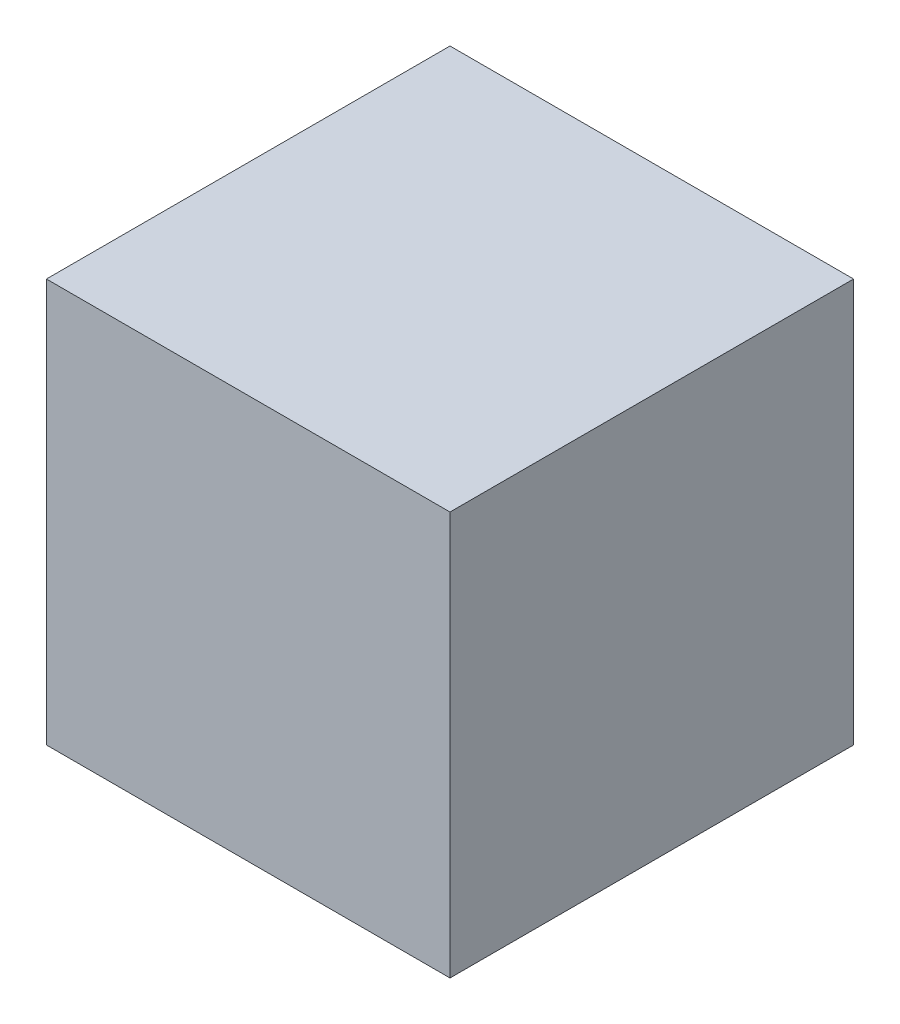
ISO-10303-21;
HEADER;
FILE_DESCRIPTION(('STEP AP214'),'2;1');
FILE_NAME('part.step','',(''),(''),'','','');
FILE_SCHEMA(('AUTOMOTIVE_DESIGN { 1 0 10303 214 1 1 1 1 }'));
ENDSEC;
DATA;
#1=APPLICATION_CONTEXT('core data for automotive mechanical design processes');
#2=APPLICATION_PROTOCOL_DEFINITION('international standard','automotive_design',2000,#1);
#3=PRODUCT_CONTEXT('',#1,'mechanical');
#4=PRODUCT('Part','Part','',(#3));
#5=PRODUCT_RELATED_PRODUCT_CATEGORY('part','',(#4));
#6=PRODUCT_DEFINITION_FORMATION('','',#4);
#7=PRODUCT_DEFINITION_CONTEXT('part definition',#1,'design');
#8=PRODUCT_DEFINITION('design','',#6,#7);
#9=PRODUCT_DEFINITION_SHAPE('','',#8);
#10=(LENGTH_UNIT() NAMED_UNIT(*) SI_UNIT(.MILLI.,.METRE.));
#11=(NAMED_UNIT(*) PLANE_ANGLE_UNIT() SI_UNIT($,.RADIAN.));
#12=(NAMED_UNIT(*) SI_UNIT($,.STERADIAN.) SOLID_ANGLE_UNIT());
#13=UNCERTAINTY_MEASURE_WITH_UNIT(LENGTH_MEASURE(1.E-05),#10,'distance_accuracy_value','');
#14=(GEOMETRIC_REPRESENTATION_CONTEXT(3) GLOBAL_UNCERTAINTY_ASSIGNED_CONTEXT((#13)) GLOBAL_UNIT_ASSIGNED_CONTEXT((#10,
#11,#12)) REPRESENTATION_CONTEXT('',''));
#15=CARTESIAN_POINT('',(0.,0.,0.));
#16=DIRECTION('',(0.,0.,1.));
#17=DIRECTION('',(1.,0.,0.));
#18=AXIS2_PLACEMENT_3D('',#15,#16,#17);
#19=CARTESIAN_POINT('',(0.,50.,50.));
#20=DIRECTION('',(1.,0.,0.));
#21=DIRECTION('',(0.,0.,-1.));
#22=AXIS2_PLACEMENT_3D('',#19,#20,#21);
#23=PLANE('',#22);
#24=DIRECTION('',(0.,-1.,0.));
#25=VECTOR('',#24,1.);
#26=CARTESIAN_POINT('',(0.,50.,0.));
#27=LINE('',#26,#25);
#28=CARTESIAN_POINT('',(0.,50.,0.));
#29=VERTEX_POINT('',#28);
#30=CARTESIAN_POINT('',(0.,0.,0.));
#31=VERTEX_POINT('',#30);
#32=EDGE_CURVE('E96',#29,#31,#27,.T.);
#33=ORIENTED_EDGE('',*,*,#32,.T.);
#34=DIRECTION('',(0.,0.,-1.));
#35=VECTOR('',#34,1.);
#36=CARTESIAN_POINT('',(0.,0.,50.));
#37=LINE('',#36,#35);
#38=CARTESIAN_POINT('',(0.,0.,50.));
#39=VERTEX_POINT('',#38);
#40=EDGE_CURVE('E11',#39,#31,#37,.T.);
#41=ORIENTED_EDGE('',*,*,#40,.F.);
#42=DIRECTION('',(0.,-1.,0.));
#43=VECTOR('',#42,1.);
#44=CARTESIAN_POINT('',(0.,50.,50.));
#45=LINE('',#44,#43);
#46=CARTESIAN_POINT('',(0.,50.,50.));
#47=VERTEX_POINT('',#46);
#48=EDGE_CURVE('E84',#47,#39,#45,.T.);
#49=ORIENTED_EDGE('',*,*,#48,.F.);
#50=DIRECTION('',(0.,0.,-1.));
#51=VECTOR('',#50,1.);
#52=CARTESIAN_POINT('',(0.,50.,50.));
#53=LINE('',#52,#51);
#54=EDGE_CURVE('E92',#47,#29,#53,.T.);
#55=ORIENTED_EDGE('',*,*,#54,.T.);
#56=EDGE_LOOP('',(#33,#41,#49,#55));
#57=FACE_BOUND('',#56,.T.);
#58=ADVANCED_FACE('F33',(#57),#23,.F.);
#59=CARTESIAN_POINT('',(0.,0.,50.));
#60=DIRECTION('',(0.,1.,0.));
#61=DIRECTION('',(0.,0.,1.));
#62=AXIS2_PLACEMENT_3D('',#59,#60,#61);
#63=PLANE('',#62);
#64=DIRECTION('',(1.,0.,0.));
#65=VECTOR('',#64,1.);
#66=CARTESIAN_POINT('',(0.,0.,0.));
#67=LINE('',#66,#65);
#68=CARTESIAN_POINT('',(50.,0.,0.));
#69=VERTEX_POINT('',#68);
#70=EDGE_CURVE('E88',#31,#69,#67,.T.);
#71=ORIENTED_EDGE('',*,*,#70,.T.);
#72=DIRECTION('',(0.,0.,-1.));
#73=VECTOR('',#72,1.);
#74=CARTESIAN_POINT('',(50.,0.,50.));
#75=LINE('',#74,#73);
#76=CARTESIAN_POINT('',(50.,0.,50.));
#77=VERTEX_POINT('',#76);
#78=EDGE_CURVE('E41',#77,#69,#75,.T.);
#79=ORIENTED_EDGE('',*,*,#78,.F.);
#80=DIRECTION('',(1.,0.,0.));
#81=VECTOR('',#80,1.);
#82=CARTESIAN_POINT('',(0.,0.,50.));
#83=LINE('',#82,#81);
#84=EDGE_CURVE('E79',#39,#77,#83,.T.);
#85=ORIENTED_EDGE('',*,*,#84,.F.);
#86=ORIENTED_EDGE('',*,*,#40,.T.);
#87=EDGE_LOOP('',(#71,#79,#85,#86));
#88=FACE_BOUND('',#87,.T.);
#89=ADVANCED_FACE('F87',(#88),#63,.F.);
#90=CARTESIAN_POINT('',(50.,0.,50.));
#91=DIRECTION('',(-1.,0.,0.));
#92=DIRECTION('',(0.,0.,1.));
#93=AXIS2_PLACEMENT_3D('',#90,#91,#92);
#94=PLANE('',#93);
#95=DIRECTION('',(0.,1.,0.));
#96=VECTOR('',#95,1.);
#97=CARTESIAN_POINT('',(50.,0.,0.));
#98=LINE('',#97,#96);
#99=CARTESIAN_POINT('',(50.,50.,0.));
#100=VERTEX_POINT('',#99);
#101=EDGE_CURVE('E66',#69,#100,#98,.T.);
#102=ORIENTED_EDGE('',*,*,#101,.T.);
#103=DIRECTION('',(0.,0.,-1.));
#104=VECTOR('',#103,1.);
#105=CARTESIAN_POINT('',(50.,50.,50.));
#106=LINE('',#105,#104);
#107=CARTESIAN_POINT('',(50.,50.,50.));
#108=VERTEX_POINT('',#107);
#109=EDGE_CURVE('E89',#108,#100,#106,.T.);
#110=ORIENTED_EDGE('',*,*,#109,.F.);
#111=DIRECTION('',(0.,1.,0.));
#112=VECTOR('',#111,1.);
#113=CARTESIAN_POINT('',(50.,0.,50.));
#114=LINE('',#113,#112);
#115=EDGE_CURVE('E82',#77,#108,#114,.T.);
#116=ORIENTED_EDGE('',*,*,#115,.F.);
#117=ORIENTED_EDGE('',*,*,#78,.T.);
#118=EDGE_LOOP('',(#102,#110,#116,#117));
#119=FACE_BOUND('',#118,.T.);
#120=ADVANCED_FACE('F90',(#119),#94,.F.);
#121=CARTESIAN_POINT('',(50.,50.,50.));
#122=DIRECTION('',(0.,-1.,0.));
#123=DIRECTION('',(1.,0.,0.));
#124=AXIS2_PLACEMENT_3D('',#121,#122,#123);
#125=PLANE('',#124);
#126=DIRECTION('',(-1.,0.,0.));
#127=VECTOR('',#126,1.);
#128=CARTESIAN_POINT('',(50.,50.,0.));
#129=LINE('',#128,#127);
#130=EDGE_CURVE('E72',#100,#29,#129,.T.);
#131=ORIENTED_EDGE('',*,*,#130,.T.);
#132=ORIENTED_EDGE('',*,*,#54,.F.);
#133=DIRECTION('',(-1.,0.,0.));
#134=VECTOR('',#133,1.);
#135=CARTESIAN_POINT('',(50.,50.,50.));
#136=LINE('',#135,#134);
#137=EDGE_CURVE('E49',#108,#47,#136,.T.);
#138=ORIENTED_EDGE('',*,*,#137,.F.);
#139=ORIENTED_EDGE('',*,*,#109,.T.);
#140=EDGE_LOOP('',(#131,#132,#138,#139));
#141=FACE_BOUND('',#140,.T.);
#142=ADVANCED_FACE('F103',(#141),#125,.F.);
#143=CARTESIAN_POINT('',(0.,0.,50.));
#144=DIRECTION('',(0.,0.,1.));
#145=DIRECTION('',(1.,0.,0.));
#146=AXIS2_PLACEMENT_3D('',#143,#144,#145);
#147=PLANE('',#146);
#148=ORIENTED_EDGE('',*,*,#48,.T.);
#149=ORIENTED_EDGE('',*,*,#84,.T.);
#150=ORIENTED_EDGE('',*,*,#115,.T.);
#151=ORIENTED_EDGE('',*,*,#137,.T.);
#152=EDGE_LOOP('',(#148,#149,#150,#151));
#153=FACE_BOUND('',#152,.T.);
#154=ADVANCED_FACE('F80',(#153),#147,.T.);
#155=CARTESIAN_POINT('',(0.,0.,0.));
#156=DIRECTION('',(0.,0.,1.));
#157=DIRECTION('',(1.,0.,0.));
#158=AXIS2_PLACEMENT_3D('',#155,#156,#157);
#159=PLANE('',#158);
#160=ORIENTED_EDGE('',*,*,#32,.F.);
#161=ORIENTED_EDGE('',*,*,#130,.F.);
#162=ORIENTED_EDGE('',*,*,#101,.F.);
#163=ORIENTED_EDGE('',*,*,#70,.F.);
#164=EDGE_LOOP('',(#160,#161,#162,#163));
#165=FACE_BOUND('',#164,.T.);
#166=ADVANCED_FACE('F106',(#165),#159,.F.);
#167=CLOSED_SHELL('',(#58,#89,#120,#142,#154,#166));
#168=MANIFOLD_SOLID_BREP('B2',#167);
#169=ADVANCED_BREP_SHAPE_REPRESENTATION('',(#18,#168),#14);
#170=SHAPE_DEFINITION_REPRESENTATION(#9,#169);
ENDSEC;
END-ISO-10303-21;
